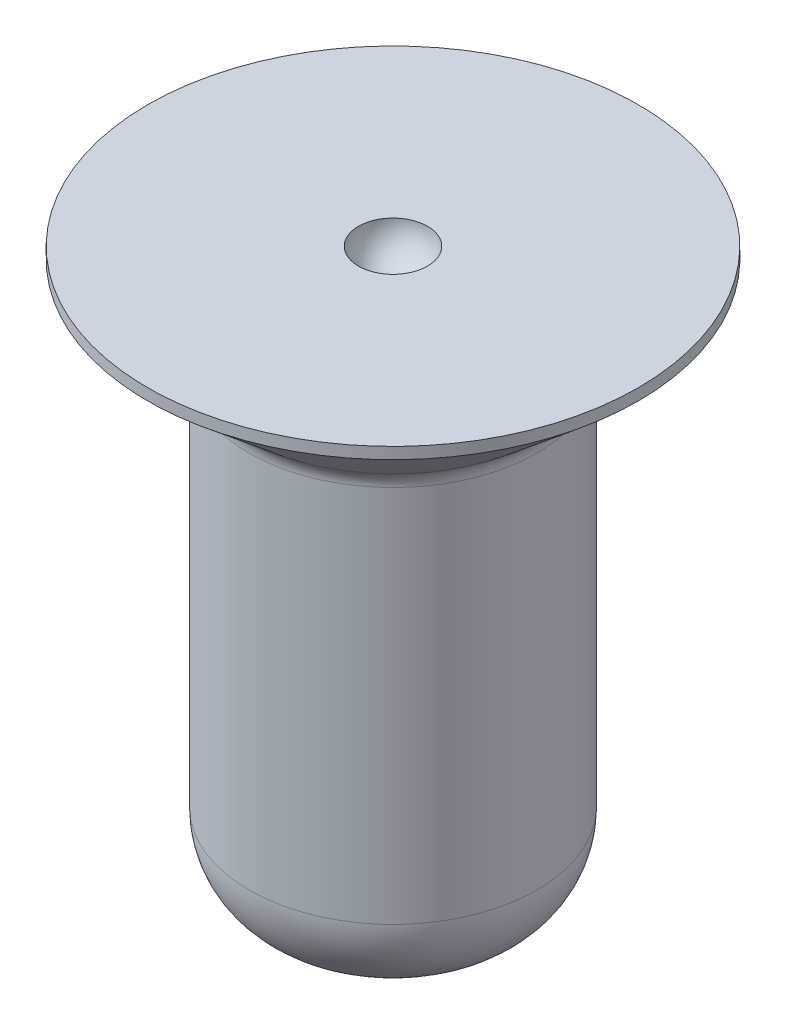
ISO-10303-21;
HEADER;
FILE_DESCRIPTION(('STEP AP214'),'2;1');
FILE_NAME('part.step','',(''),(''),'','','');
FILE_SCHEMA(('AUTOMOTIVE_DESIGN { 1 0 10303 214 1 1 1 1 }'));
ENDSEC;
DATA;
#1=APPLICATION_CONTEXT('core data for automotive mechanical design processes');
#2=APPLICATION_PROTOCOL_DEFINITION('international standard','automotive_design',2000,#1);
#3=PRODUCT_CONTEXT('',#1,'mechanical');
#4=PRODUCT('Part','Part','',(#3));
#5=PRODUCT_RELATED_PRODUCT_CATEGORY('part','',(#4));
#6=PRODUCT_DEFINITION_FORMATION('','',#4);
#7=PRODUCT_DEFINITION_CONTEXT('part definition',#1,'design');
#8=PRODUCT_DEFINITION('design','',#6,#7);
#9=PRODUCT_DEFINITION_SHAPE('','',#8);
#10=(LENGTH_UNIT() NAMED_UNIT(*) SI_UNIT(.MILLI.,.METRE.));
#11=(NAMED_UNIT(*) PLANE_ANGLE_UNIT() SI_UNIT($,.RADIAN.));
#12=(NAMED_UNIT(*) SI_UNIT($,.STERADIAN.) SOLID_ANGLE_UNIT());
#13=UNCERTAINTY_MEASURE_WITH_UNIT(LENGTH_MEASURE(1.E-05),#10,'distance_accuracy_value','');
#14=(GEOMETRIC_REPRESENTATION_CONTEXT(3) GLOBAL_UNCERTAINTY_ASSIGNED_CONTEXT((#13)) GLOBAL_UNIT_ASSIGNED_CONTEXT((#10,
#11,#12)) REPRESENTATION_CONTEXT('',''));
#15=CARTESIAN_POINT('',(0.,0.,0.));
#16=DIRECTION('',(0.,0.,1.));
#17=DIRECTION('',(1.,0.,0.));
#18=AXIS2_PLACEMENT_3D('',#15,#16,#17);
#19=CARTESIAN_POINT('',(0.,-6.35,0.));
#20=DIRECTION('',(0.,1.,0.));
#21=DIRECTION('',(-1.,0.,0.));
#22=AXIS2_PLACEMENT_3D('',#19,#20,#21);
#23=PLANE('',#22);
#24=CARTESIAN_POINT('',(0.,-6.35,0.));
#25=DIRECTION('',(0.,1.,0.));
#26=DIRECTION('',(-1.,0.,0.));
#27=AXIS2_PLACEMENT_3D('',#24,#25,#26);
#28=CIRCLE('',#27,0.596900000000001);
#29=CARTESIAN_POINT('',(-0.596899999999996,-6.35,0.));
#30=VERTEX_POINT('',#29);
#31=EDGE_CURVE('E10',#30,#30,#28,.T.);
#32=ORIENTED_EDGE('',*,*,#31,.F.);
#33=EDGE_LOOP('',(#32));
#34=FACE_BOUND('',#33,.T.);
#35=ADVANCED_FACE('F32',(#34),#23,.F.);
#36=CARTESIAN_POINT('',(0.,-5.3594,0.));
#37=DIRECTION('',(0.,1.,0.));
#38=DIRECTION('',(-1.,0.,0.));
#39=AXIS2_PLACEMENT_3D('',#36,#37,#38);
#40=DEGENERATE_TOROIDAL_SURFACE('',#39,0.596900000000001,0.990599999999999,.T.);
#41=CARTESIAN_POINT('',(0.,-5.3594,0.));
#42=DIRECTION('',(0.,1.,0.));
#43=DIRECTION('',(-1.,0.,0.));
#44=AXIS2_PLACEMENT_3D('',#41,#42,#43);
#45=CIRCLE('',#44,1.5875);
#46=CARTESIAN_POINT('',(-1.5875,-5.3594,0.));
#47=VERTEX_POINT('',#46);
#48=EDGE_CURVE('E38',#47,#47,#45,.T.);
#49=ORIENTED_EDGE('',*,*,#48,.F.);
#50=EDGE_LOOP('',(#49));
#51=FACE_BOUND('',#50,.T.);
#52=ORIENTED_EDGE('',*,*,#31,.T.);
#53=EDGE_LOOP('',(#52));
#54=FACE_BOUND('',#53,.T.);
#55=ADVANCED_FACE('F89',(#51,#54),#40,.T.);
#56=CARTESIAN_POINT('',(0.,28.4494992070967,0.));
#57=DIRECTION('',(0.,1.,0.));
#58=DIRECTION('',(-1.,0.,0.));
#59=AXIS2_PLACEMENT_3D('',#56,#57,#58);
#60=CYLINDRICAL_SURFACE('',#59,1.5875);
#61=CARTESIAN_POINT('',(0.,-1.18409867676652,0.));
#62=DIRECTION('',(0.,1.,0.));
#63=DIRECTION('',(-1.,0.,0.));
#64=AXIS2_PLACEMENT_3D('',#61,#62,#63);
#65=CIRCLE('',#64,1.5875);
#66=CARTESIAN_POINT('',(-1.5875,-1.18409867676652,0.));
#67=VERTEX_POINT('',#66);
#68=EDGE_CURVE('E42',#67,#67,#65,.T.);
#69=ORIENTED_EDGE('',*,*,#68,.F.);
#70=EDGE_LOOP('',(#69));
#71=FACE_BOUND('',#70,.T.);
#72=ORIENTED_EDGE('',*,*,#48,.T.);
#73=EDGE_LOOP('',(#72));
#74=FACE_BOUND('',#73,.T.);
#75=ADVANCED_FACE('F84',(#71,#74),#60,.T.);
#76=CARTESIAN_POINT('',(0.,-1.18409867676653,0.));
#77=DIRECTION('',(0.,1.,0.));
#78=DIRECTION('',(-1.,0.,0.));
#79=AXIS2_PLACEMENT_3D('',#76,#77,#78);
#80=TOROIDAL_SURFACE('',#79,1.84150000000001,0.254000000000006);
#81=CARTESIAN_POINT('',(0.,-0.989523388214297,0.));
#82=DIRECTION('',(0.,1.,0.));
#83=DIRECTION('',(-1.,0.,0.));
#84=AXIS2_PLACEMENT_3D('',#81,#82,#83);
#85=CIRCLE('',#84,1.67823194713962);
#86=CARTESIAN_POINT('',(-1.67823194713962,-0.989523388214297,0.));
#87=VERTEX_POINT('',#86);
#88=EDGE_CURVE('E46',#87,#87,#85,.T.);
#89=ORIENTED_EDGE('',*,*,#88,.F.);
#90=EDGE_LOOP('',(#89));
#91=FACE_BOUND('',#90,.T.);
#92=ORIENTED_EDGE('',*,*,#68,.T.);
#93=EDGE_LOOP('',(#92));
#94=FACE_BOUND('',#93,.T.);
#95=ADVANCED_FACE('F78',(#91,#94),#80,.F.);
#96=CARTESIAN_POINT('',(0.,-0.989523388214297,0.));
#97=DIRECTION('',(0.,1.,0.));
#98=DIRECTION('',(-1.,0.,0.));
#99=AXIS2_PLACEMENT_3D('',#96,#97,#98);
#100=CONICAL_SURFACE('',#99,1.67823194713962,0.872664625997159);
#101=CARTESIAN_POINT('',(0.,-0.126999999999995,0.));
#102=DIRECTION('',(0.,1.,0.));
#103=DIRECTION('',(-1.,0.,0.));
#104=AXIS2_PLACEMENT_3D('',#101,#102,#103);
#105=CIRCLE('',#104,2.70614729374053);
#106=CARTESIAN_POINT('',(-2.70614729374053,-0.126999999999996,0.));
#107=VERTEX_POINT('',#106);
#108=EDGE_CURVE('E51',#107,#107,#105,.T.);
#109=ORIENTED_EDGE('',*,*,#108,.F.);
#110=EDGE_LOOP('',(#109));
#111=FACE_BOUND('',#110,.T.);
#112=ORIENTED_EDGE('',*,*,#88,.T.);
#113=EDGE_LOOP('',(#112));
#114=FACE_BOUND('',#113,.T.);
#115=ADVANCED_FACE('F72',(#111,#114),#100,.T.);
#116=CARTESIAN_POINT('',(0.,28.4494992070967,0.));
#117=DIRECTION('',(0.,1.,0.));
#118=DIRECTION('',(-1.,0.,0.));
#119=AXIS2_PLACEMENT_3D('',#116,#117,#118);
#120=CYLINDRICAL_SURFACE('',#119,2.70614729374053);
#121=CARTESIAN_POINT('',(0.,0.,0.));
#122=DIRECTION('',(0.,1.,0.));
#123=DIRECTION('',(-1.,0.,0.));
#124=AXIS2_PLACEMENT_3D('',#121,#122,#123);
#125=CIRCLE('',#124,2.70614729374053);
#126=CARTESIAN_POINT('',(-2.70614729374053,0.,0.));
#127=VERTEX_POINT('',#126);
#128=EDGE_CURVE('E54',#127,#127,#125,.T.);
#129=ORIENTED_EDGE('',*,*,#128,.F.);
#130=EDGE_LOOP('',(#129));
#131=FACE_BOUND('',#130,.T.);
#132=ORIENTED_EDGE('',*,*,#108,.T.);
#133=EDGE_LOOP('',(#132));
#134=FACE_BOUND('',#133,.T.);
#135=ADVANCED_FACE('F66',(#131,#134),#120,.T.);
#136=CARTESIAN_POINT('',(2.70614729374054,0.,0.));
#137=DIRECTION('',(0.,-1.,0.));
#138=DIRECTION('',(1.,0.,0.));
#139=AXIS2_PLACEMENT_3D('',#136,#137,#138);
#140=PLANE('',#139);
#141=CARTESIAN_POINT('',(0.,0.,0.));
#142=DIRECTION('',(0.,1.,0.));
#143=DIRECTION('',(-1.,0.,0.));
#144=AXIS2_PLACEMENT_3D('',#141,#142,#143);
#145=CIRCLE('',#144,0.380999999999997);
#146=CARTESIAN_POINT('',(-0.380999999999993,0.,0.));
#147=VERTEX_POINT('',#146);
#148=EDGE_CURVE('E57',#147,#147,#145,.T.);
#149=ORIENTED_EDGE('',*,*,#148,.F.);
#150=EDGE_LOOP('',(#149));
#151=FACE_BOUND('',#150,.T.);
#152=ORIENTED_EDGE('',*,*,#128,.T.);
#153=EDGE_LOOP('',(#152));
#154=FACE_BOUND('',#153,.T.);
#155=ADVANCED_FACE('F63',(#151,#154),#140,.F.);
#156=CARTESIAN_POINT('',(0.,0.,0.));
#157=DIRECTION('',(0.,1.,0.));
#158=DIRECTION('',(1.,0.,0.));
#159=AXIS2_PLACEMENT_3D('',#156,#157,#158);
#160=SPHERICAL_SURFACE('',#159,0.381);
#161=ORIENTED_EDGE('',*,*,#148,.T.);
#162=EDGE_LOOP('',(#161));
#163=FACE_BOUND('',#162,.T.);
#164=ADVANCED_FACE('F61',(#163),#160,.F.);
#165=CLOSED_SHELL('',(#35,#55,#75,#95,#115,#135,#155,#164));
#166=MANIFOLD_SOLID_BREP('B2',#165);
#167=ADVANCED_BREP_SHAPE_REPRESENTATION('',(#18,#166),#14);
#168=SHAPE_DEFINITION_REPRESENTATION(#9,#167);
ENDSEC;
END-ISO-10303-21;
